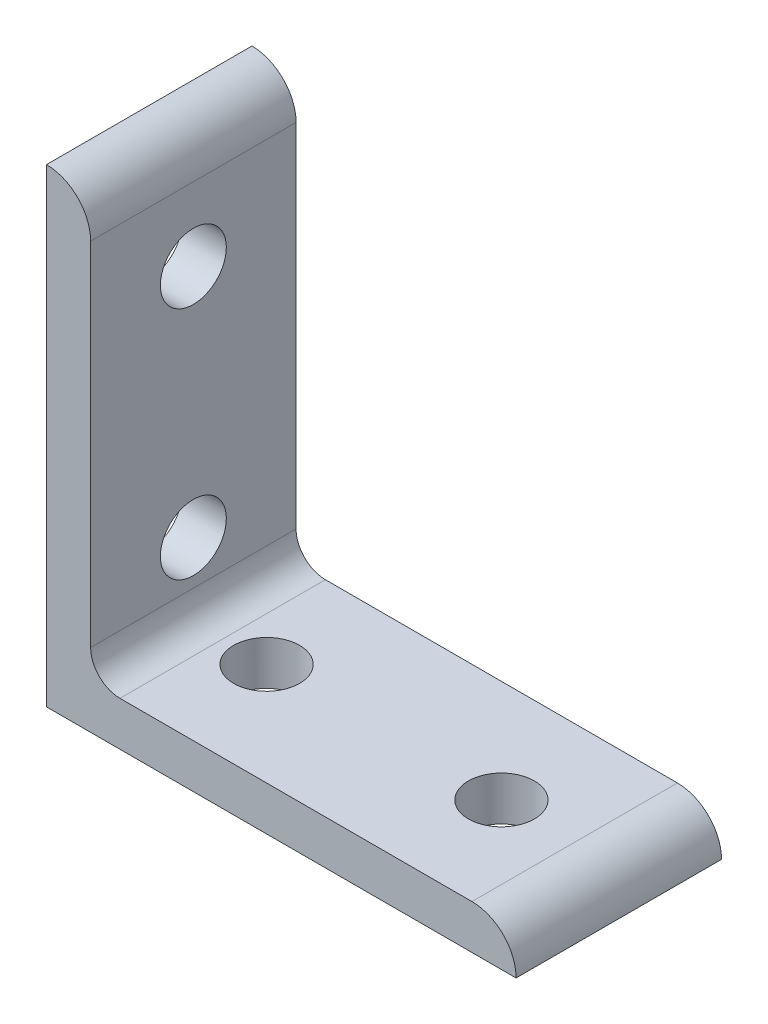
ISO-10303-21;
HEADER;
FILE_DESCRIPTION(('STEP AP214'),'2;1');
FILE_NAME('part.step','',(''),(''),'','','');
FILE_SCHEMA(('AUTOMOTIVE_DESIGN { 1 0 10303 214 1 1 1 1 }'));
ENDSEC;
DATA;
#1=APPLICATION_CONTEXT('core data for automotive mechanical design processes');
#2=APPLICATION_PROTOCOL_DEFINITION('international standard','automotive_design',2000,#1);
#3=PRODUCT_CONTEXT('',#1,'mechanical');
#4=PRODUCT('Part','Part','',(#3));
#5=PRODUCT_RELATED_PRODUCT_CATEGORY('part','',(#4));
#6=PRODUCT_DEFINITION_FORMATION('','',#4);
#7=PRODUCT_DEFINITION_CONTEXT('part definition',#1,'design');
#8=PRODUCT_DEFINITION('design','',#6,#7);
#9=PRODUCT_DEFINITION_SHAPE('','',#8);
#10=(LENGTH_UNIT() NAMED_UNIT(*) SI_UNIT(.MILLI.,.METRE.));
#11=(NAMED_UNIT(*) PLANE_ANGLE_UNIT() SI_UNIT($,.RADIAN.));
#12=(NAMED_UNIT(*) SI_UNIT($,.STERADIAN.) SOLID_ANGLE_UNIT());
#13=UNCERTAINTY_MEASURE_WITH_UNIT(LENGTH_MEASURE(1.E-05),#10,'distance_accuracy_value','');
#14=(GEOMETRIC_REPRESENTATION_CONTEXT(3) GLOBAL_UNCERTAINTY_ASSIGNED_CONTEXT((#13)) GLOBAL_UNIT_ASSIGNED_CONTEXT((#10,
#11,#12)) REPRESENTATION_CONTEXT('',''));
#15=CARTESIAN_POINT('',(0.,0.,0.));
#16=DIRECTION('',(0.,0.,1.));
#17=DIRECTION('',(1.,0.,0.));
#18=AXIS2_PLACEMENT_3D('',#15,#16,#17);
#19=CARTESIAN_POINT('',(4.7752,46.0248,11.1125));
#20=DIRECTION('',(-1.,0.,0.));
#21=DIRECTION('',(0.,-1.,0.));
#22=AXIS2_PLACEMENT_3D('',#19,#20,#21);
#23=PLANE('',#22);
#24=CARTESIAN_POINT('',(4.7752,12.7,0.));
#25=DIRECTION('',(-1.,0.,0.));
#26=DIRECTION('',(0.,-1.,0.));
#27=AXIS2_PLACEMENT_3D('',#24,#25,#26);
#28=CIRCLE('',#27,3.5687);
#29=CARTESIAN_POINT('',(4.7752,9.1313,0.));
#30=VERTEX_POINT('',#29);
#31=EDGE_CURVE('E194',#30,#30,#28,.F.);
#32=ORIENTED_EDGE('',*,*,#31,.F.);
#33=EDGE_LOOP('',(#32));
#34=FACE_BOUND('',#33,.T.);
#35=DIRECTION('',(0.,1.,0.));
#36=VECTOR('',#35,1.);
#37=CARTESIAN_POINT('',(4.7752,46.0248,-11.1125));
#38=LINE('',#37,#36);
#39=CARTESIAN_POINT('',(4.7752,7.9502,-11.1125));
#40=VERTEX_POINT('',#39);
#41=CARTESIAN_POINT('',(4.77519999999999,46.0248,-11.1125));
#42=VERTEX_POINT('',#41);
#43=EDGE_CURVE('E115',#40,#42,#38,.T.);
#44=ORIENTED_EDGE('',*,*,#43,.T.);
#45=DIRECTION('',(0.,0.,-1.));
#46=VECTOR('',#45,1.);
#47=CARTESIAN_POINT('',(4.77519999999999,46.0248,11.1125));
#48=LINE('',#47,#46);
#49=CARTESIAN_POINT('',(4.77519999999999,46.0248,11.1125));
#50=VERTEX_POINT('',#49);
#51=EDGE_CURVE('E112',#50,#42,#48,.T.);
#52=ORIENTED_EDGE('',*,*,#51,.F.);
#53=DIRECTION('',(0.,1.,0.));
#54=VECTOR('',#53,1.);
#55=CARTESIAN_POINT('',(4.7752,46.0248,11.1125));
#56=LINE('',#55,#54);
#57=CARTESIAN_POINT('',(4.7752,7.9502,11.1125));
#58=VERTEX_POINT('',#57);
#59=EDGE_CURVE('E101',#58,#50,#56,.T.);
#60=ORIENTED_EDGE('',*,*,#59,.F.);
#61=DIRECTION('',(0.,0.,-1.));
#62=VECTOR('',#61,1.);
#63=CARTESIAN_POINT('',(4.7752,7.9502,11.1125));
#64=LINE('',#63,#62);
#65=EDGE_CURVE('E116',#58,#40,#64,.T.);
#66=ORIENTED_EDGE('',*,*,#65,.T.);
#67=EDGE_LOOP('',(#44,#52,#60,#66));
#68=FACE_BOUND('',#67,.T.);
#69=CARTESIAN_POINT('',(4.77519999999999,38.1,0.));
#70=DIRECTION('',(-1.,0.,0.));
#71=DIRECTION('',(0.,-1.,0.));
#72=AXIS2_PLACEMENT_3D('',#69,#70,#71);
#73=CIRCLE('',#72,3.5687);
#74=CARTESIAN_POINT('',(4.77519999999999,34.5313,0.));
#75=VERTEX_POINT('',#74);
#76=EDGE_CURVE('E187',#75,#75,#73,.F.);
#77=ORIENTED_EDGE('',*,*,#76,.F.);
#78=EDGE_LOOP('',(#77));
#79=FACE_BOUND('',#78,.T.);
#80=ADVANCED_FACE('F32',(#34,#68,#79),#23,.F.);
#81=CARTESIAN_POINT('',(0.,0.,11.1125));
#82=DIRECTION('',(1.,0.,0.));
#83=DIRECTION('',(0.,0.,-1.));
#84=AXIS2_PLACEMENT_3D('',#81,#82,#83);
#85=PLANE('',#84);
#86=CARTESIAN_POINT('',(0.,12.7,0.));
#87=DIRECTION('',(1.,0.,0.));
#88=DIRECTION('',(0.,0.,-1.));
#89=AXIS2_PLACEMENT_3D('',#86,#87,#88);
#90=CIRCLE('',#89,3.5687);
#91=CARTESIAN_POINT('',(0.,12.7,-3.5687));
#92=VERTEX_POINT('',#91);
#93=EDGE_CURVE('E190',#92,#92,#90,.T.);
#94=ORIENTED_EDGE('',*,*,#93,.T.);
#95=EDGE_LOOP('',(#94));
#96=FACE_BOUND('',#95,.T.);
#97=DIRECTION('',(0.,-1.,0.));
#98=VECTOR('',#97,1.);
#99=CARTESIAN_POINT('',(0.,0.,-11.1125));
#100=LINE('',#99,#98);
#101=CARTESIAN_POINT('',(0.,50.8,-11.1125));
#102=VERTEX_POINT('',#101);
#103=CARTESIAN_POINT('',(0.,0.,-11.1125));
#104=VERTEX_POINT('',#103);
#105=EDGE_CURVE('E83',#102,#104,#100,.T.);
#106=ORIENTED_EDGE('',*,*,#105,.T.);
#107=DIRECTION('',(0.,0.,-1.));
#108=VECTOR('',#107,1.);
#109=CARTESIAN_POINT('',(0.,0.,11.1125));
#110=LINE('',#109,#108);
#111=CARTESIAN_POINT('',(0.,0.,11.1125));
#112=VERTEX_POINT('',#111);
#113=EDGE_CURVE('E121',#112,#104,#110,.T.);
#114=ORIENTED_EDGE('',*,*,#113,.F.);
#115=DIRECTION('',(0.,-1.,0.));
#116=VECTOR('',#115,1.);
#117=CARTESIAN_POINT('',(0.,0.,11.1125));
#118=LINE('',#117,#116);
#119=CARTESIAN_POINT('',(0.,50.8,11.1125));
#120=VERTEX_POINT('',#119);
#121=EDGE_CURVE('E51',#120,#112,#118,.T.);
#122=ORIENTED_EDGE('',*,*,#121,.F.);
#123=DIRECTION('',(0.,0.,-1.));
#124=VECTOR('',#123,1.);
#125=CARTESIAN_POINT('',(0.,50.8,11.1125));
#126=LINE('',#125,#124);
#127=EDGE_CURVE('E117',#120,#102,#126,.T.);
#128=ORIENTED_EDGE('',*,*,#127,.T.);
#129=EDGE_LOOP('',(#106,#114,#122,#128));
#130=FACE_BOUND('',#129,.T.);
#131=CARTESIAN_POINT('',(0.,38.1,0.));
#132=DIRECTION('',(1.,0.,0.));
#133=DIRECTION('',(0.,0.,-1.));
#134=AXIS2_PLACEMENT_3D('',#131,#132,#133);
#135=CIRCLE('',#134,3.5687);
#136=CARTESIAN_POINT('',(0.,38.1,-3.5687));
#137=VERTEX_POINT('',#136);
#138=EDGE_CURVE('E185',#137,#137,#135,.T.);
#139=ORIENTED_EDGE('',*,*,#138,.T.);
#140=EDGE_LOOP('',(#139));
#141=FACE_BOUND('',#140,.T.);
#142=ADVANCED_FACE('F178',(#96,#130,#141),#85,.F.);
#143=CARTESIAN_POINT('',(50.8,0.,11.1125));
#144=DIRECTION('',(0.,1.,0.));
#145=DIRECTION('',(-1.,0.,0.));
#146=AXIS2_PLACEMENT_3D('',#143,#144,#145);
#147=PLANE('',#146);
#148=CARTESIAN_POINT('',(12.7,0.,0.));
#149=DIRECTION('',(0.,1.,0.));
#150=DIRECTION('',(0.,0.,1.));
#151=AXIS2_PLACEMENT_3D('',#148,#149,#150);
#152=CIRCLE('',#151,3.5687);
#153=CARTESIAN_POINT('',(12.7,0.,3.5687));
#154=VERTEX_POINT('',#153);
#155=EDGE_CURVE('E147',#154,#154,#152,.T.);
#156=ORIENTED_EDGE('',*,*,#155,.T.);
#157=EDGE_LOOP('',(#156));
#158=FACE_BOUND('',#157,.T.);
#159=DIRECTION('',(1.,0.,0.));
#160=VECTOR('',#159,1.);
#161=CARTESIAN_POINT('',(50.8,0.,-11.1125));
#162=LINE('',#161,#160);
#163=CARTESIAN_POINT('',(50.8,0.,-11.1125));
#164=VERTEX_POINT('',#163);
#165=EDGE_CURVE('E125',#104,#164,#162,.T.);
#166=ORIENTED_EDGE('',*,*,#165,.T.);
#167=DIRECTION('',(0.,0.,-1.));
#168=VECTOR('',#167,1.);
#169=CARTESIAN_POINT('',(50.8,0.,11.1125));
#170=LINE('',#169,#168);
#171=CARTESIAN_POINT('',(50.8,0.,11.1125));
#172=VERTEX_POINT('',#171);
#173=EDGE_CURVE('E11',#172,#164,#170,.T.);
#174=ORIENTED_EDGE('',*,*,#173,.F.);
#175=DIRECTION('',(1.,0.,0.));
#176=VECTOR('',#175,1.);
#177=CARTESIAN_POINT('',(50.8,0.,11.1125));
#178=LINE('',#177,#176);
#179=EDGE_CURVE('E138',#112,#172,#178,.T.);
#180=ORIENTED_EDGE('',*,*,#179,.F.);
#181=ORIENTED_EDGE('',*,*,#113,.T.);
#182=EDGE_LOOP('',(#166,#174,#180,#181));
#183=FACE_BOUND('',#182,.T.);
#184=CARTESIAN_POINT('',(38.1,0.,0.));
#185=DIRECTION('',(0.,1.,0.));
#186=DIRECTION('',(0.,0.,1.));
#187=AXIS2_PLACEMENT_3D('',#184,#185,#186);
#188=CIRCLE('',#187,3.56869999999999);
#189=CARTESIAN_POINT('',(38.1,0.,3.56869999999999));
#190=VERTEX_POINT('',#189);
#191=EDGE_CURVE('E155',#190,#190,#188,.T.);
#192=ORIENTED_EDGE('',*,*,#191,.T.);
#193=EDGE_LOOP('',(#192));
#194=FACE_BOUND('',#193,.T.);
#195=ADVANCED_FACE('F34',(#158,#183,#194),#147,.F.);
#196=CARTESIAN_POINT('',(7.9502,4.7752,11.1125));
#197=DIRECTION('',(0.,-1.,0.));
#198=DIRECTION('',(1.,0.,0.));
#199=AXIS2_PLACEMENT_3D('',#196,#197,#198);
#200=PLANE('',#199);
#201=CARTESIAN_POINT('',(12.7,4.7752,0.));
#202=DIRECTION('',(0.,-1.,0.));
#203=DIRECTION('',(1.,0.,0.));
#204=AXIS2_PLACEMENT_3D('',#201,#202,#203);
#205=CIRCLE('',#204,3.5687);
#206=CARTESIAN_POINT('',(16.2687,4.7752,0.));
#207=VERTEX_POINT('',#206);
#208=EDGE_CURVE('E129',#207,#207,#205,.F.);
#209=ORIENTED_EDGE('',*,*,#208,.F.);
#210=EDGE_LOOP('',(#209));
#211=FACE_BOUND('',#210,.T.);
#212=DIRECTION('',(-1.,0.,0.));
#213=VECTOR('',#212,1.);
#214=CARTESIAN_POINT('',(7.9502,4.7752,-11.1125));
#215=LINE('',#214,#213);
#216=CARTESIAN_POINT('',(46.0248,4.7752,-11.1125));
#217=VERTEX_POINT('',#216);
#218=CARTESIAN_POINT('',(7.9502,4.7752,-11.1125));
#219=VERTEX_POINT('',#218);
#220=EDGE_CURVE('E131',#217,#219,#215,.T.);
#221=ORIENTED_EDGE('',*,*,#220,.T.);
#222=DIRECTION('',(0.,0.,-1.));
#223=VECTOR('',#222,1.);
#224=CARTESIAN_POINT('',(7.9502,4.7752,11.1125));
#225=LINE('',#224,#223);
#226=CARTESIAN_POINT('',(7.9502,4.7752,11.1125));
#227=VERTEX_POINT('',#226);
#228=EDGE_CURVE('E142',#227,#219,#225,.T.);
#229=ORIENTED_EDGE('',*,*,#228,.F.);
#230=DIRECTION('',(-1.,0.,0.));
#231=VECTOR('',#230,1.);
#232=CARTESIAN_POINT('',(7.9502,4.7752,11.1125));
#233=LINE('',#232,#231);
#234=CARTESIAN_POINT('',(46.0248,4.7752,11.1125));
#235=VERTEX_POINT('',#234);
#236=EDGE_CURVE('E161',#235,#227,#233,.T.);
#237=ORIENTED_EDGE('',*,*,#236,.F.);
#238=DIRECTION('',(0.,0.,-1.));
#239=VECTOR('',#238,1.);
#240=CARTESIAN_POINT('',(46.0248,4.7752,11.1125));
#241=LINE('',#240,#239);
#242=EDGE_CURVE('E42',#235,#217,#241,.T.);
#243=ORIENTED_EDGE('',*,*,#242,.T.);
#244=EDGE_LOOP('',(#221,#229,#237,#243));
#245=FACE_BOUND('',#244,.T.);
#246=CARTESIAN_POINT('',(38.1,4.7752,0.));
#247=DIRECTION('',(0.,-1.,0.));
#248=DIRECTION('',(1.,0.,0.));
#249=AXIS2_PLACEMENT_3D('',#246,#247,#248);
#250=CIRCLE('',#249,3.56869999999999);
#251=CARTESIAN_POINT('',(41.6687,4.7752,0.));
#252=VERTEX_POINT('',#251);
#253=EDGE_CURVE('E36',#252,#252,#250,.F.);
#254=ORIENTED_EDGE('',*,*,#253,.F.);
#255=EDGE_LOOP('',(#254));
#256=FACE_BOUND('',#255,.T.);
#257=ADVANCED_FACE('F165',(#211,#245,#256),#200,.F.);
#258=CARTESIAN_POINT('',(46.0248,0.,11.1125));
#259=DIRECTION('',(0.,0.,-1.));
#260=DIRECTION('',(-1.,0.,0.));
#261=AXIS2_PLACEMENT_3D('',#258,#259,#260);
#262=CYLINDRICAL_SURFACE('',#261,4.7752);
#263=CARTESIAN_POINT('',(46.0248,0.,-11.1125));
#264=DIRECTION('',(0.,0.,1.));
#265=DIRECTION('',(1.,0.,0.));
#266=AXIS2_PLACEMENT_3D('',#263,#264,#265);
#267=CIRCLE('',#266,4.7752);
#268=EDGE_CURVE('E128',#164,#217,#267,.T.);
#269=ORIENTED_EDGE('',*,*,#268,.T.);
#270=ORIENTED_EDGE('',*,*,#242,.F.);
#271=CARTESIAN_POINT('',(46.0248,0.,11.1125));
#272=DIRECTION('',(0.,0.,1.));
#273=DIRECTION('',(1.,0.,0.));
#274=AXIS2_PLACEMENT_3D('',#271,#272,#273);
#275=CIRCLE('',#274,4.7752);
#276=EDGE_CURVE('E91',#172,#235,#275,.T.);
#277=ORIENTED_EDGE('',*,*,#276,.F.);
#278=ORIENTED_EDGE('',*,*,#173,.T.);
#279=EDGE_LOOP('',(#269,#270,#277,#278));
#280=FACE_BOUND('',#279,.T.);
#281=ADVANCED_FACE('F209',(#280),#262,.T.);
#282=CARTESIAN_POINT('',(7.9502,7.9502,11.1125));
#283=DIRECTION('',(0.,0.,-1.));
#284=DIRECTION('',(-1.,0.,0.));
#285=AXIS2_PLACEMENT_3D('',#282,#283,#284);
#286=CYLINDRICAL_SURFACE('',#285,3.175);
#287=CARTESIAN_POINT('',(7.9502,7.9502,-11.1125));
#288=DIRECTION('',(0.,0.,-1.));
#289=DIRECTION('',(1.,0.,0.));
#290=AXIS2_PLACEMENT_3D('',#287,#288,#289);
#291=CIRCLE('',#290,3.175);
#292=EDGE_CURVE('E133',#219,#40,#291,.T.);
#293=ORIENTED_EDGE('',*,*,#292,.T.);
#294=ORIENTED_EDGE('',*,*,#65,.F.);
#295=CARTESIAN_POINT('',(7.9502,7.9502,11.1125));
#296=DIRECTION('',(0.,0.,-1.));
#297=DIRECTION('',(1.,0.,0.));
#298=AXIS2_PLACEMENT_3D('',#295,#296,#297);
#299=CIRCLE('',#298,3.175);
#300=EDGE_CURVE('E107',#227,#58,#299,.T.);
#301=ORIENTED_EDGE('',*,*,#300,.F.);
#302=ORIENTED_EDGE('',*,*,#228,.T.);
#303=EDGE_LOOP('',(#293,#294,#301,#302));
#304=FACE_BOUND('',#303,.T.);
#305=ADVANCED_FACE('F170',(#304),#286,.F.);
#306=CARTESIAN_POINT('',(0.,46.0248,11.1125));
#307=DIRECTION('',(0.,0.,-1.));
#308=DIRECTION('',(-1.,0.,0.));
#309=AXIS2_PLACEMENT_3D('',#306,#307,#308);
#310=CYLINDRICAL_SURFACE('',#309,4.77519999999999);
#311=CARTESIAN_POINT('',(0.,46.0248,-11.1125));
#312=DIRECTION('',(0.,0.,1.));
#313=DIRECTION('',(1.,0.,0.));
#314=AXIS2_PLACEMENT_3D('',#311,#312,#313);
#315=CIRCLE('',#314,4.77519999999999);
#316=EDGE_CURVE('E77',#42,#102,#315,.T.);
#317=ORIENTED_EDGE('',*,*,#316,.T.);
#318=ORIENTED_EDGE('',*,*,#127,.F.);
#319=CARTESIAN_POINT('',(0.,46.0248,11.1125));
#320=DIRECTION('',(0.,0.,1.));
#321=DIRECTION('',(1.,0.,0.));
#322=AXIS2_PLACEMENT_3D('',#319,#320,#321);
#323=CIRCLE('',#322,4.77519999999999);
#324=EDGE_CURVE('E105',#50,#120,#323,.T.);
#325=ORIENTED_EDGE('',*,*,#324,.F.);
#326=ORIENTED_EDGE('',*,*,#51,.T.);
#327=EDGE_LOOP('',(#317,#318,#325,#326));
#328=FACE_BOUND('',#327,.T.);
#329=ADVANCED_FACE('F119',(#328),#310,.T.);
#330=CARTESIAN_POINT('',(0.,46.0248,11.1125));
#331=DIRECTION('',(0.,0.,1.));
#332=DIRECTION('',(1.,0.,0.));
#333=AXIS2_PLACEMENT_3D('',#330,#331,#332);
#334=PLANE('',#333);
#335=ORIENTED_EDGE('',*,*,#179,.T.);
#336=ORIENTED_EDGE('',*,*,#276,.T.);
#337=ORIENTED_EDGE('',*,*,#236,.T.);
#338=ORIENTED_EDGE('',*,*,#300,.T.);
#339=ORIENTED_EDGE('',*,*,#59,.T.);
#340=ORIENTED_EDGE('',*,*,#324,.T.);
#341=ORIENTED_EDGE('',*,*,#121,.T.);
#342=EDGE_LOOP('',(#335,#336,#337,#338,#339,#340,#341));
#343=FACE_BOUND('',#342,.T.);
#344=ADVANCED_FACE('F103',(#343),#334,.T.);
#345=CARTESIAN_POINT('',(0.,46.0248,-11.1125));
#346=DIRECTION('',(0.,0.,1.));
#347=DIRECTION('',(1.,0.,0.));
#348=AXIS2_PLACEMENT_3D('',#345,#346,#347);
#349=PLANE('',#348);
#350=ORIENTED_EDGE('',*,*,#165,.F.);
#351=ORIENTED_EDGE('',*,*,#105,.F.);
#352=ORIENTED_EDGE('',*,*,#316,.F.);
#353=ORIENTED_EDGE('',*,*,#43,.F.);
#354=ORIENTED_EDGE('',*,*,#292,.F.);
#355=ORIENTED_EDGE('',*,*,#220,.F.);
#356=ORIENTED_EDGE('',*,*,#268,.F.);
#357=EDGE_LOOP('',(#350,#351,#352,#353,#354,#355,#356));
#358=FACE_BOUND('',#357,.T.);
#359=ADVANCED_FACE('F173',(#358),#349,.F.);
#360=CARTESIAN_POINT('',(12.7,50.8,0.));
#361=DIRECTION('',(0.,-1.,0.));
#362=DIRECTION('',(0.,0.,-1.));
#363=AXIS2_PLACEMENT_3D('',#360,#361,#362);
#364=CYLINDRICAL_SURFACE('',#363,3.5687);
#365=ORIENTED_EDGE('',*,*,#155,.F.);
#366=EDGE_LOOP('',(#365));
#367=FACE_BOUND('',#366,.T.);
#368=ORIENTED_EDGE('',*,*,#208,.T.);
#369=EDGE_LOOP('',(#368));
#370=FACE_BOUND('',#369,.T.);
#371=ADVANCED_FACE('F205',(#367,#370),#364,.F.);
#372=CARTESIAN_POINT('',(38.1,50.8,0.));
#373=DIRECTION('',(0.,-1.,0.));
#374=DIRECTION('',(0.,0.,-1.));
#375=AXIS2_PLACEMENT_3D('',#372,#373,#374);
#376=CYLINDRICAL_SURFACE('',#375,3.56869999999999);
#377=ORIENTED_EDGE('',*,*,#191,.F.);
#378=EDGE_LOOP('',(#377));
#379=FACE_BOUND('',#378,.T.);
#380=ORIENTED_EDGE('',*,*,#253,.T.);
#381=EDGE_LOOP('',(#380));
#382=FACE_BOUND('',#381,.T.);
#383=ADVANCED_FACE('F201',(#379,#382),#376,.F.);
#384=CARTESIAN_POINT('',(50.8,12.7,0.));
#385=DIRECTION('',(-1.,0.,0.));
#386=DIRECTION('',(0.,0.,1.));
#387=AXIS2_PLACEMENT_3D('',#384,#385,#386);
#388=CYLINDRICAL_SURFACE('',#387,3.5687);
#389=ORIENTED_EDGE('',*,*,#93,.F.);
#390=EDGE_LOOP('',(#389));
#391=FACE_BOUND('',#390,.T.);
#392=ORIENTED_EDGE('',*,*,#31,.T.);
#393=EDGE_LOOP('',(#392));
#394=FACE_BOUND('',#393,.T.);
#395=ADVANCED_FACE('F204',(#391,#394),#388,.F.);
#396=CARTESIAN_POINT('',(50.8,38.1,0.));
#397=DIRECTION('',(-1.,0.,0.));
#398=DIRECTION('',(0.,0.,1.));
#399=AXIS2_PLACEMENT_3D('',#396,#397,#398);
#400=CYLINDRICAL_SURFACE('',#399,3.5687);
#401=ORIENTED_EDGE('',*,*,#138,.F.);
#402=EDGE_LOOP('',(#401));
#403=FACE_BOUND('',#402,.T.);
#404=ORIENTED_EDGE('',*,*,#76,.T.);
#405=EDGE_LOOP('',(#404));
#406=FACE_BOUND('',#405,.T.);
#407=ADVANCED_FACE('F241',(#403,#406),#400,.F.);
#408=CLOSED_SHELL('',(#80,#142,#195,#257,#281,#305,#329,#344,#359,#371,#383,#395,#407));
#409=MANIFOLD_SOLID_BREP('B2',#408);
#410=ADVANCED_BREP_SHAPE_REPRESENTATION('',(#18,#409),#14);
#411=SHAPE_DEFINITION_REPRESENTATION(#9,#410);
ENDSEC;
END-ISO-10303-21;
